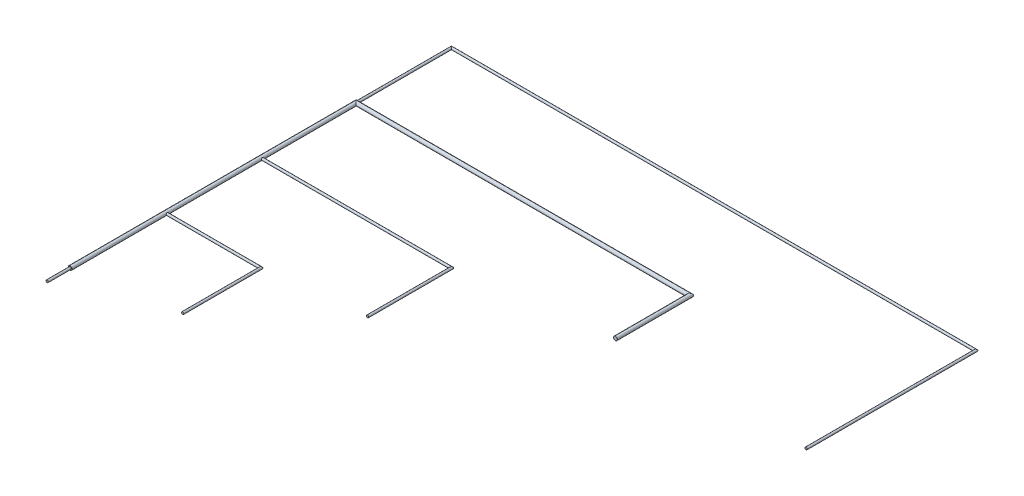
ISO-10303-21;
HEADER;
FILE_DESCRIPTION(('STEP AP214'),'2;1');
FILE_NAME('part.step','',(''),(''),'','','');
FILE_SCHEMA(('AUTOMOTIVE_DESIGN { 1 0 10303 214 1 1 1 1 }'));
ENDSEC;
DATA;
#1=APPLICATION_CONTEXT('core data for automotive mechanical design processes');
#2=APPLICATION_PROTOCOL_DEFINITION('international standard','automotive_design',2000,#1);
#3=PRODUCT_CONTEXT('',#1,'mechanical');
#4=PRODUCT('Part','Part','',(#3));
#5=PRODUCT_RELATED_PRODUCT_CATEGORY('part','',(#4));
#6=PRODUCT_DEFINITION_FORMATION('','',#4);
#7=PRODUCT_DEFINITION_CONTEXT('part definition',#1,'design');
#8=PRODUCT_DEFINITION('design','',#6,#7);
#9=PRODUCT_DEFINITION_SHAPE('','',#8);
#10=(LENGTH_UNIT() NAMED_UNIT(*) SI_UNIT(.MILLI.,.METRE.));
#11=(NAMED_UNIT(*) PLANE_ANGLE_UNIT() SI_UNIT($,.RADIAN.));
#12=(NAMED_UNIT(*) SI_UNIT($,.STERADIAN.) SOLID_ANGLE_UNIT());
#13=UNCERTAINTY_MEASURE_WITH_UNIT(LENGTH_MEASURE(1.E-05),#10,'distance_accuracy_value','');
#14=(GEOMETRIC_REPRESENTATION_CONTEXT(3) GLOBAL_UNCERTAINTY_ASSIGNED_CONTEXT((#13)) GLOBAL_UNIT_ASSIGNED_CONTEXT((#10,
#11,#12)) REPRESENTATION_CONTEXT('',''));
#15=CARTESIAN_POINT('',(0.,0.,0.));
#16=DIRECTION('',(0.,0.,1.));
#17=DIRECTION('',(1.,0.,0.));
#18=AXIS2_PLACEMENT_3D('',#15,#16,#17);
#19=CARTESIAN_POINT('',(1130.21115526702,0.,-225.94745807334));
#20=DIRECTION('',(0.,0.,-1.));
#21=DIRECTION('',(-1.,0.,0.));
#22=AXIS2_PLACEMENT_3D('',#19,#20,#21);
#23=CYLINDRICAL_SURFACE('',#22,0.599999999999934);
#24=CARTESIAN_POINT('',(1130.21115526702,0.,-438.01885807334));
#25=DIRECTION('',(0.707106781186547,0.,-0.707106781186548));
#26=DIRECTION('',(-0.707106781186548,0.,-0.707106781186547));
#27=AXIS2_PLACEMENT_3D('',#24,#25,#26);
#28=ELLIPSE('',#27,0.848528137423764,0.599999999999934);
#29=CARTESIAN_POINT('',(1129.61115526702,0.,-438.618858073339));
#30=VERTEX_POINT('',#29);
#31=EDGE_CURVE('E83',#30,#30,#28,.T.);
#32=ORIENTED_EDGE('',*,*,#31,.F.);
#33=EDGE_LOOP('',(#32));
#34=FACE_BOUND('',#33,.T.);
#35=CARTESIAN_POINT('',(1129.61115526701,0.,-389.018858073339));
#36=CARTESIAN_POINT('',(1129.61115690342,0.0306919333858949,-389.018856576493));
#37=CARTESIAN_POINT('',(1129.61352673538,0.0614329282579737,-389.017429691798));
#38=CARTESIAN_POINT('',(1129.62288499482,0.121990203811974,-389.011857687775));
#39=CARTESIAN_POINT('',(1129.62988481175,0.15180401383831,-389.007705865471));
#40=CARTESIAN_POINT('',(1129.64810981148,0.209500731116331,-388.997104305557));
#41=CARTESIAN_POINT('',(1129.65931405028,0.237392411290542,-388.990665966431));
#42=CARTESIAN_POINT('',(1129.68549940027,0.290812127285728,-388.976039543845));
#43=CARTESIAN_POINT('',(1129.7004795738,0.316340747766442,-388.96785189486));
#44=CARTESIAN_POINT('',(1129.73506519769,0.366519711599597,-388.949679516216));
#45=CARTESIAN_POINT('',(1129.75493674515,0.390953608032397,-388.939605242123));
#46=CARTESIAN_POINT('',(1129.79814214854,0.436353081647392,-388.918979830458));
#47=CARTESIAN_POINT('',(1129.82148044189,0.457314139792309,-388.908428093954));
#48=CARTESIAN_POINT('',(1129.87432467121,0.497779987051815,-388.886502341323));
#49=CARTESIAN_POINT('',(1129.9042359754,0.516791065515184,-388.875186144154));
#50=CARTESIAN_POINT('',(1129.96749389631,0.549445751059541,-388.854611278988));
#51=CARTESIAN_POINT('',(1130.00083482551,0.563098069340574,-388.845349282435));
#52=CARTESIAN_POINT('',(1130.06179384727,0.581762406856822,-388.832276591983));
#53=CARTESIAN_POINT('',(1130.08884966646,0.58806478898725,-388.82768960589));
#54=CARTESIAN_POINT('',(1130.14387675334,0.596864689361843,-388.821219306521));
#55=CARTESIAN_POINT('',(1130.17184683851,0.599366938227287,-388.819332631914));
#56=CARTESIAN_POINT('',(1130.2279598647,0.600422035183957,-388.818541763195));
#57=CARTESIAN_POINT('',(1130.25610303705,0.598967133633585,-388.81964342139));
#58=CARTESIAN_POINT('',(1130.31166677718,0.592184241915266,-388.824671119114));
#59=CARTESIAN_POINT('',(1130.33908678535,0.586853338480403,-388.828599283068));
#60=CARTESIAN_POINT('',(1130.39216736386,0.572695687527157,-388.838670821116));
#61=CARTESIAN_POINT('',(1130.41784608858,0.563914994664295,-388.844784919949));
#62=CARTESIAN_POINT('',(1130.46743326338,0.543180247083277,-388.858566278743));
#63=CARTESIAN_POINT('',(1130.49134106038,0.531225029038775,-388.866234107833));
#64=CARTESIAN_POINT('',(1130.54114890586,0.502071932738287,-388.883879382415));
#65=CARTESIAN_POINT('',(1130.56666650419,0.484322897590811,-388.894026246831));
#66=CARTESIAN_POINT('',(1130.61462586048,0.445164371135946,-388.914580472397));
#67=CARTESIAN_POINT('',(1130.6370646406,0.42375138040229,-388.924988074388));
#68=CARTESIAN_POINT('',(1130.68140045974,0.374324733753188,-388.946600093172));
#69=CARTESIAN_POINT('',(1130.70278618942,0.345807073081961,-388.957713418413));
#70=CARTESIAN_POINT('',(1130.74040408589,0.284910420183557,-388.977947787075));
#71=CARTESIAN_POINT('',(1130.75663900853,0.252533505577382,-388.987069895041));
#72=CARTESIAN_POINT('',(1130.78232814013,0.186879034107236,-389.001779641604));
#73=CARTESIAN_POINT('',(1130.7921454093,0.153787049669384,-389.007553903098));
#74=CARTESIAN_POINT('',(1130.80595974597,0.0860191580578282,-389.015733444593));
#75=CARTESIAN_POINT('',(1130.80996379411,0.0513452022645219,-389.01814276515));
#76=CARTESIAN_POINT('',(1130.81175840608,-0.0134858457509754,-389.019220354838));
#77=CARTESIAN_POINT('',(1130.81031880904,-0.0436169893675314,-389.018352160197));
#78=CARTESIAN_POINT('',(1130.80298492578,-0.103131760794398,-389.013972921687));
#79=CARTESIAN_POINT('',(1130.79709072989,-0.132515403750318,-389.010461931411));
#80=CARTESIAN_POINT('',(1130.78133789389,-0.189029972863197,-389.001237243109));
#81=CARTESIAN_POINT('',(1130.77157912738,-0.216198300371908,-388.995579175991));
#82=CARTESIAN_POINT('',(1130.74848431646,-0.268506299634327,-388.982513596789));
#83=CARTESIAN_POINT('',(1130.73514756647,-0.29364556998353,-388.975105739678));
#84=CARTESIAN_POINT('',(1130.70373247533,-0.344002505131811,-388.958240058297));
#85=CARTESIAN_POINT('',(1130.68530573537,-0.368957660191516,-388.948649284329));
#86=CARTESIAN_POINT('',(1130.64499870962,-0.415610412515243,-388.928755135608));
#87=CARTESIAN_POINT('',(1130.62311440509,-0.437304161061994,-388.91845093957));
#88=CARTESIAN_POINT('',(1130.57319111098,-0.47972798697968,-388.896639769109));
#89=CARTESIAN_POINT('',(1130.54472171274,-0.499964078671362,-388.885151040839));
#90=CARTESIAN_POINT('',(1130.48426885713,-0.535380955795318,-388.863722801924));
#91=CARTESIAN_POINT('',(1130.4522891495,-0.550567067086843,-388.853781665067));
#92=CARTESIAN_POINT('',(1130.39265805806,-0.572570315173131,-388.83879771051));
#93=CARTESIAN_POINT('',(1130.36556314194,-0.580486501398291,-388.833160711591));
#94=CARTESIAN_POINT('',(1130.31014243564,-0.592454655691181,-388.824496497273));
#95=CARTESIAN_POINT('',(1130.28181840924,-0.596511981208456,-388.821465664168));
#96=CARTESIAN_POINT('',(1130.224604488,-0.600536521649434,-388.818459859545));
#97=CARTESIAN_POINT('',(1130.19571287074,-0.60048835642688,-388.818496379054));
#98=CARTESIAN_POINT('',(1130.13839749276,-0.596265891841779,-388.82164894498));
#99=CARTESIAN_POINT('',(1130.10997399498,-0.592089348864038,-388.824766665912));
#100=CARTESIAN_POINT('',(1130.05575989998,-0.58016069659456,-388.833390814294));
#101=CARTESIAN_POINT('',(1130.02990842929,-0.572590547381463,-388.838774920558));
#102=CARTESIAN_POINT('',(1129.97982036522,-0.554252968307818,-388.851280081183));
#103=CARTESIAN_POINT('',(1129.95558438423,-0.543484334352395,-388.858401789497));
#104=CARTESIAN_POINT('',(1129.90542732412,-0.517156982224273,-388.874910035548));
#105=CARTESIAN_POINT('',(1129.87981882547,-0.501116670709484,-388.884476423695));
#106=CARTESIAN_POINT('',(1129.83140323796,-0.465502793549489,-388.904138581437));
#107=CARTESIAN_POINT('',(1129.80859848214,-0.445926318405886,-388.914234782063));
#108=CARTESIAN_POINT('',(1129.76261488737,-0.400039109730087,-388.935760834618));
#109=CARTESIAN_POINT('',(1129.73998283711,-0.373150727838681,-388.947139308445));
#110=CARTESIAN_POINT('',(1129.69951612475,-0.315384973870352,-388.968319789204));
#111=CARTESIAN_POINT('',(1129.68168318229,-0.284506177785585,-388.978121230543));
#112=CARTESIAN_POINT('',(1129.65204094391,-0.220450092325539,-388.994800387998));
#113=CARTESIAN_POINT('',(1129.64006404084,-0.187372034906759,-389.001758383768));
#114=CARTESIAN_POINT('',(1129.62206538875,-0.119189322581194,-389.012323165858));
#115=CARTESIAN_POINT('',(1129.61602119985,-0.0840928398848035,-389.015942576879));
#116=CARTESIAN_POINT('',(1129.61247628513,-0.040623238764281,-389.018066078));
#117=CARTESIAN_POINT('',(1129.61198150009,-0.0325105036104452,-389.018362531961));
#118=CARTESIAN_POINT('',(1129.61132076846,-0.016266328275469,-389.018758731412));
#119=CARTESIAN_POINT('',(1129.61115483328,-0.00813488745527394,-389.018858470078));
#120=CARTESIAN_POINT('',(1129.61115526701,0.,-389.018858073339));
#121=B_SPLINE_CURVE_WITH_KNOTS('',3,(#35,#36,#37,#38,#39,#40,#41,#42,#43,#44,#45,#46,#47,#48,
#49,#50,#51,#52,#53,#54,#55,#56,#57,#58,#59,#60,#61,#62,#63,#64,#65,#66,#67,#68,#69,#70,#71,#72,
#73,#74,#75,#76,#77,#78,#79,#80,#81,#82,#83,#84,#85,#86,#87,#88,#89,#90,#91,#92,#93,#94,#95,#96,
#97,#98,#99,#100,#101,#102,#103,#104,#105,#106,#107,#108,#109,#110,#111,#112,#113,#114,#115,
#116,#117,#118,#119,#120),.UNSPECIFIED.,.T.,.F.,(4,2,2,2,2,2,2,2,2,2,2,2,2,2,2,2,2,2,2,2,2,2,2,
2,2,2,2,2,2,2,2,2,2,2,2,2,2,2,2,2,2,2,4),(0.,0.0920408950194668,0.184309051007966,
0.276123553839829,0.36791527919678,0.466726362929681,0.565665031739066,0.676735252759133,
0.787624162768262,0.871735319422605,0.955741683666319,1.03991268348259,1.12414701309529,
1.20729307037276,1.29046963923941,1.38818798090043,1.48600017921455,1.59744383153856,
1.70882775710112,1.81318716278605,1.91742114767272,2.00750241088949,2.09758184745361,
2.18547114275886,2.27337778263583,2.37040546327317,2.46754676032715,2.57734704971191,
2.68703117046105,2.77303114921538,2.85891155484627,2.9451137030223,3.03136272453559,
3.11345639323728,3.19558100600502,3.2903144401221,3.38512617739355,3.49541724702322,
3.60574778406051,3.71270261782474,3.81925132875583,3.84364589335862,3.86804130412835),.UNSPECIFIED.);
#122=CARTESIAN_POINT('',(1129.61115526701,0.,-389.018858073339));
#123=VERTEX_POINT('',#122);
#124=EDGE_CURVE('E107',#123,#123,#121,.T.);
#125=ORIENTED_EDGE('',*,*,#124,.T.);
#126=EDGE_LOOP('',(#125));
#127=FACE_BOUND('',#126,.T.);
#128=ADVANCED_FACE('F56',(#34,#127),#23,.T.);
#129=CARTESIAN_POINT('',(1405.21172112185,0.,-349.018858073308));
#130=DIRECTION('',(0.,0.,-1.));
#131=DIRECTION('',(-1.,0.,0.));
#132=AXIS2_PLACEMENT_3D('',#129,#130,#131);
#133=PLANE('',#132);
#134=CARTESIAN_POINT('',(1405.21172112185,0.,-349.018858073308));
#135=DIRECTION('',(0.,0.,-1.));
#136=DIRECTION('',(-1.,0.,0.));
#137=AXIS2_PLACEMENT_3D('',#134,#135,#136);
#138=CIRCLE('',#137,0.599999999999934);
#139=CARTESIAN_POINT('',(1404.61172112185,0.,-349.018858073308));
#140=VERTEX_POINT('',#139);
#141=EDGE_CURVE('E187',#140,#140,#138,.T.);
#142=ORIENTED_EDGE('',*,*,#141,.F.);
#143=EDGE_LOOP('',(#142));
#144=FACE_BOUND('',#143,.T.);
#145=ADVANCED_FACE('F97',(#144),#133,.F.);
#146=CARTESIAN_POINT('',(1405.21172112185,0.,-438.77885807334));
#147=DIRECTION('',(0.,0.,1.));
#148=DIRECTION('',(1.,0.,0.));
#149=AXIS2_PLACEMENT_3D('',#146,#147,#148);
#150=CYLINDRICAL_SURFACE('',#149,0.599999999999934);
#151=CARTESIAN_POINT('',(1405.21172112185,0.,-438.01885807334));
#152=DIRECTION('',(0.707106781186548,0.,0.707106781186547));
#153=DIRECTION('',(0.707106781186547,0.,-0.707106781186548));
#154=AXIS2_PLACEMENT_3D('',#151,#152,#153);
#155=ELLIPSE('',#154,0.848528137423764,0.599999999999934);
#156=CARTESIAN_POINT('',(1405.81172112185,0.,-438.61885807334));
#157=VERTEX_POINT('',#156);
#158=EDGE_CURVE('E189',#157,#157,#155,.T.);
#159=ORIENTED_EDGE('',*,*,#158,.T.);
#160=EDGE_LOOP('',(#159));
#161=FACE_BOUND('',#160,.T.);
#162=ORIENTED_EDGE('',*,*,#141,.T.);
#163=EDGE_LOOP('',(#162));
#164=FACE_BOUND('',#163,.T.);
#165=ADVANCED_FACE('F145',(#161,#164),#150,.T.);
#166=CARTESIAN_POINT('',(1129.45115526702,0.,-438.01885807334));
#167=DIRECTION('',(1.,0.,0.));
#168=DIRECTION('',(0.,0.,-1.));
#169=AXIS2_PLACEMENT_3D('',#166,#167,#168);
#170=CYLINDRICAL_SURFACE('',#169,0.599999999999934);
#171=ORIENTED_EDGE('',*,*,#31,.T.);
#172=EDGE_LOOP('',(#171));
#173=FACE_BOUND('',#172,.T.);
#174=ORIENTED_EDGE('',*,*,#158,.F.);
#175=EDGE_LOOP('',(#174));
#176=FACE_BOUND('',#175,.T.);
#177=ADVANCED_FACE('F94',(#173,#176),#170,.T.);
#178=CARTESIAN_POINT('',(1130.21115526702,0.,-238.018858073339));
#179=DIRECTION('',(0.,0.,-1.));
#180=DIRECTION('',(-1.,0.,0.));
#181=AXIS2_PLACEMENT_3D('',#178,#179,#180);
#182=CYLINDRICAL_SURFACE('',#181,0.99999999999989);
#183=CARTESIAN_POINT('',(1130.21115526702,0.,-388.01885807334));
#184=DIRECTION('',(0.707106781186547,0.,-0.707106781186549));
#185=DIRECTION('',(-0.707106781186549,0.,-0.707106781186547));
#186=AXIS2_PLACEMENT_3D('',#183,#184,#185);
#187=ELLIPSE('',#186,1.41421356237294,0.99999999999989);
#188=CARTESIAN_POINT('',(1129.21115526702,0.,-389.01885807334));
#189=VERTEX_POINT('',#188);
#190=EDGE_CURVE('E114',#189,#189,#187,.T.);
#191=ORIENTED_EDGE('',*,*,#190,.F.);
#192=EDGE_LOOP('',(#191));
#193=FACE_BOUND('',#192,.T.);
#194=CARTESIAN_POINT('',(1130.21115526702,0.,-238.018858073339));
#195=DIRECTION('',(0.,0.,1.));
#196=DIRECTION('',(1.,0.,0.));
#197=AXIS2_PLACEMENT_3D('',#194,#195,#196);
#198=CIRCLE('',#197,0.99999999999989);
#199=CARTESIAN_POINT('',(1131.21115526702,0.,-238.018858073339));
#200=VERTEX_POINT('',#199);
#201=EDGE_CURVE('E169',#200,#200,#198,.T.);
#202=ORIENTED_EDGE('',*,*,#201,.F.);
#203=EDGE_LOOP('',(#202));
#204=FACE_BOUND('',#203,.T.);
#205=CARTESIAN_POINT('',(1131.21115526702,0.,-288.61885807334));
#206=CARTESIAN_POINT('',(1131.21115377017,0.03069193338588,-288.618856436934));
#207=CARTESIAN_POINT('',(1131.20972688547,0.0614329282579533,-288.616486604969));
#208=CARTESIAN_POINT('',(1131.20415488145,0.12199020381197,-288.607128345534));
#209=CARTESIAN_POINT('',(1131.20000305915,0.151804013838328,-288.600128528598));
#210=CARTESIAN_POINT('',(1131.18940149923,0.209500731116393,-288.581903528873));
#211=CARTESIAN_POINT('',(1131.18296316011,0.237392411290624,-288.570699290074));
#212=CARTESIAN_POINT('',(1131.16833673752,0.290812127285816,-288.544513940083));
#213=CARTESIAN_POINT('',(1131.16014908854,0.316340747766523,-288.529533766552));
#214=CARTESIAN_POINT('',(1131.14197670989,0.366519711599711,-288.494948142656));
#215=CARTESIAN_POINT('',(1131.1319024358,0.390953608032539,-288.475076595199));
#216=CARTESIAN_POINT('',(1131.11127702413,0.436353081647509,-288.431871191808));
#217=CARTESIAN_POINT('',(1131.10072528763,0.457314139792382,-288.408532898465));
#218=CARTESIAN_POINT('',(1131.078799535,0.497779987051835,-288.355688669141));
#219=CARTESIAN_POINT('',(1131.06748333783,0.516791065515192,-288.325777364947));
#220=CARTESIAN_POINT('',(1131.04690847266,0.549445751059541,-288.262519444042));
#221=CARTESIAN_POINT('',(1131.03764647611,0.563098069340577,-288.229178514841));
#222=CARTESIAN_POINT('',(1131.02457378566,0.581762406856821,-288.168219493078));
#223=CARTESIAN_POINT('',(1131.01998679957,0.588064788987247,-288.141163673896));
#224=CARTESIAN_POINT('',(1131.0135165002,0.596864689361843,-288.086136587008));
#225=CARTESIAN_POINT('',(1131.01162982559,0.59936693822728,-288.058166501838));
#226=CARTESIAN_POINT('',(1131.01083895687,0.600422035183966,-288.002053475653));
#227=CARTESIAN_POINT('',(1131.01194061507,0.598967133633607,-287.973910303302));
#228=CARTESIAN_POINT('',(1131.01696831279,0.592184241915244,-287.918346563169));
#229=CARTESIAN_POINT('',(1131.02089647674,0.586853338480342,-287.890926555001));
#230=CARTESIAN_POINT('',(1131.03096801479,0.572695687527111,-287.837845976488));
#231=CARTESIAN_POINT('',(1131.03708211363,0.563914994664301,-287.81216725177));
#232=CARTESIAN_POINT('',(1131.05086347242,0.543180247083291,-287.762580076969));
#233=CARTESIAN_POINT('',(1131.05853130151,0.531225029038743,-287.73867227997));
#234=CARTESIAN_POINT('',(1131.07617657609,0.502071932738263,-287.688864434491));
#235=CARTESIAN_POINT('',(1131.08632344051,0.48432289759086,-287.663346836158));
#236=CARTESIAN_POINT('',(1131.10687766607,0.445164371135994,-287.615387479873));
#237=CARTESIAN_POINT('',(1131.11728526806,0.423751380402275,-287.592948699749));
#238=CARTESIAN_POINT('',(1131.13889728685,0.374324733753142,-287.548612880611));
#239=CARTESIAN_POINT('',(1131.15001061209,0.345807073081959,-287.527227150933));
#240=CARTESIAN_POINT('',(1131.17024498075,0.284910420183596,-287.489609254461));
#241=CARTESIAN_POINT('',(1131.17936708872,0.252533505577419,-287.473374331824));
#242=CARTESIAN_POINT('',(1131.19407683528,0.186879034107278,-287.447685200221));
#243=CARTESIAN_POINT('',(1131.19985109677,0.153787049669434,-287.437867931053));
#244=CARTESIAN_POINT('',(1131.20803063827,0.0860191580578686,-287.424053594378));
#245=CARTESIAN_POINT('',(1131.21043995883,0.0513452022645445,-287.420049546238));
#246=CARTESIAN_POINT('',(1131.21151754851,-0.0134858457509748,-287.418254934268));
#247=CARTESIAN_POINT('',(1131.21064935387,-0.0436169893675355,-287.419694531306));
#248=CARTESIAN_POINT('',(1131.20627011536,-0.103131760794389,-287.427028414568));
#249=CARTESIAN_POINT('',(1131.20275912509,-0.132515403750291,-287.432922610462));
#250=CARTESIAN_POINT('',(1131.19353443678,-0.189029972863186,-287.448675446465));
#251=CARTESIAN_POINT('',(1131.18787636967,-0.216198300371929,-287.458434212969));
#252=CARTESIAN_POINT('',(1131.17481079047,-0.268506299634352,-287.481529023886));
#253=CARTESIAN_POINT('',(1131.16740293335,-0.293645569983525,-287.494865773877));
#254=CARTESIAN_POINT('',(1131.15053725197,-0.344002505131788,-287.526280865024));
#255=CARTESIAN_POINT('',(1131.14094647801,-0.368957660191513,-287.544707604976));
#256=CARTESIAN_POINT('',(1131.12105232928,-0.41561041251522,-287.58501463073));
#257=CARTESIAN_POINT('',(1131.11074813325,-0.43730416106193,-287.606898935263));
#258=CARTESIAN_POINT('',(1131.08893696279,-0.479727986979574,-287.656822229375));
#259=CARTESIAN_POINT('',(1131.07744823452,-0.499964078671267,-287.685291627606));
#260=CARTESIAN_POINT('',(1131.0560199956,-0.535380955795228,-287.745744483216));
#261=CARTESIAN_POINT('',(1131.04607885874,-0.55056706708674,-287.777724190853));
#262=CARTESIAN_POINT('',(1131.03109490419,-0.572570315173041,-287.837355282286));
#263=CARTESIAN_POINT('',(1131.02545790527,-0.580486501398218,-287.864450198412));
#264=CARTESIAN_POINT('',(1131.01679369095,-0.592454655691128,-287.919870904711));
#265=CARTESIAN_POINT('',(1131.01376285784,-0.596511981208416,-287.948194931115));
#266=CARTESIAN_POINT('',(1131.01075705322,-0.600536521649438,-288.005408852348));
#267=CARTESIAN_POINT('',(1131.01079357273,-0.600488356426889,-288.034300469606));
#268=CARTESIAN_POINT('',(1131.01394613866,-0.5962658918418,-288.091615847591));
#269=CARTESIAN_POINT('',(1131.01706385959,-0.592089348864087,-288.120039345374));
#270=CARTESIAN_POINT('',(1131.02568800797,-0.580160696594608,-288.174253440366));
#271=CARTESIAN_POINT('',(1131.03107211424,-0.572590547381477,-288.200104911062));
#272=CARTESIAN_POINT('',(1131.04357727486,-0.554252968307881,-288.25019297513));
#273=CARTESIAN_POINT('',(1131.05069898317,-0.543484334352548,-288.274428956125));
#274=CARTESIAN_POINT('',(1131.06720722922,-0.517156982224509,-288.324586016227));
#275=CARTESIAN_POINT('',(1131.07677361737,-0.501116670709692,-288.350194514878));
#276=CARTESIAN_POINT('',(1131.09643577511,-0.465502793549722,-288.39861010239));
#277=CARTESIAN_POINT('',(1131.10653197574,-0.445926318406166,-288.421414858213));
#278=CARTESIAN_POINT('',(1131.12805802829,-0.400039109730426,-288.46739845298));
#279=CARTESIAN_POINT('',(1131.13943650212,-0.373150727839025,-288.490030503245));
#280=CARTESIAN_POINT('',(1131.16061698288,-0.31538497387076,-288.530497215602));
#281=CARTESIAN_POINT('',(1131.17041842422,-0.28450617778604,-288.548330158061));
#282=CARTESIAN_POINT('',(1131.18709758167,-0.220450092326009,-288.577972396443));
#283=CARTESIAN_POINT('',(1131.19405557744,-0.187372034907199,-288.589949299515));
#284=CARTESIAN_POINT('',(1131.20462035953,-0.119189322581629,-288.6079479516));
#285=CARTESIAN_POINT('',(1131.20823977056,-0.084092839885264,-288.6139921405));
#286=CARTESIAN_POINT('',(1131.21036327168,-0.0406232387646278,-288.617537055219));
#287=CARTESIAN_POINT('',(1131.21065972564,-0.0325105036107151,-288.618031840261));
#288=CARTESIAN_POINT('',(1131.21105592509,-0.0162663282755978,-288.618692571889));
#289=CARTESIAN_POINT('',(1131.21115566375,-0.00813488745533872,-288.618858507068));
#290=CARTESIAN_POINT('',(1131.21115526702,0.,-288.61885807334));
#291=B_SPLINE_CURVE_WITH_KNOTS('',3,(#205,#206,#207,#208,#209,#210,#211,#212,#213,#214,#215,
#216,#217,#218,#219,#220,#221,#222,#223,#224,#225,#226,#227,#228,#229,#230,#231,#232,#233,#234,
#235,#236,#237,#238,#239,#240,#241,#242,#243,#244,#245,#246,#247,#248,#249,#250,#251,#252,#253,
#254,#255,#256,#257,#258,#259,#260,#261,#262,#263,#264,#265,#266,#267,#268,#269,#270,#271,#272,
#273,#274,#275,#276,#277,#278,#279,#280,#281,#282,#283,#284,#285,#286,#287,#288,#289,#290),
.UNSPECIFIED.,.T.,.F.,(4,2,2,2,2,2,2,2,2,2,2,2,2,2,2,2,2,2,2,2,2,2,2,2,2,2,2,2,2,2,2,2,2,2,2,2,
2,2,2,2,2,2,4),(0.,0.0920408950194603,0.184309051007991,0.27612355384,0.367915279196825,
0.466726362929885,0.565665031739153,0.676735252759201,0.787624162768333,0.871735319422485,
0.955741683666259,1.03991268348281,1.12414701309537,1.20729307037271,1.29046963923934,
1.38818798090051,1.48600017921447,1.59744383153856,1.70882775710112,1.81318716278604,
1.91742114767274,2.00750241088951,2.09758184745363,2.18547114275886,2.27337778263587,
2.37040546327321,2.46754676032713,2.57734704971169,2.68703117046078,2.77303114921514,
2.85891155484581,2.94511370302218,3.03136272453535,3.11345639323711,3.19558100600469,
3.29031444012166,3.38512617739318,3.49541724702265,3.60574778406001,3.71270261782427,
3.81925132875542,3.84364589335842,3.86804130412835),.UNSPECIFIED.);
#292=CARTESIAN_POINT('',(1131.21115526702,0.,-288.61885807334));
#293=VERTEX_POINT('',#292);
#294=EDGE_CURVE('E60',#293,#293,#291,.T.);
#295=ORIENTED_EDGE('',*,*,#294,.F.);
#296=EDGE_LOOP('',(#295));
#297=FACE_BOUND('',#296,.T.);
#298=CARTESIAN_POINT('',(1131.21115526702,0.,-338.61885807334));
#299=CARTESIAN_POINT('',(1131.21115377017,-0.0306919333858856,-338.618856436934));
#300=CARTESIAN_POINT('',(1131.20972688547,-0.0614329282579663,-338.616486604968));
#301=CARTESIAN_POINT('',(1131.20415488145,-0.121990203811975,-338.607128345534));
#302=CARTESIAN_POINT('',(1131.20000305915,-0.151804013838316,-338.600128528598));
#303=CARTESIAN_POINT('',(1131.18940149923,-0.209500731116355,-338.581903528873));
#304=CARTESIAN_POINT('',(1131.18296316011,-0.237392411290579,-338.570699290074));
#305=CARTESIAN_POINT('',(1131.16833673752,-0.290812127285767,-338.544513940083));
#306=CARTESIAN_POINT('',(1131.16014908854,-0.316340747766472,-338.529533766552));
#307=CARTESIAN_POINT('',(1131.14197670989,-0.366519711599663,-338.494948142656));
#308=CARTESIAN_POINT('',(1131.1319024358,-0.39095360803251,-338.475076595199));
#309=CARTESIAN_POINT('',(1131.11127702413,-0.436353081647526,-338.431871191808));
#310=CARTESIAN_POINT('',(1131.10072528763,-0.457314139792419,-338.408532898465));
#311=CARTESIAN_POINT('',(1131.078799535,-0.497779987051868,-338.355688669141));
#312=CARTESIAN_POINT('',(1131.06748333783,-0.5167910655152,-338.325777364947));
#313=CARTESIAN_POINT('',(1131.04690847266,-0.549445751059533,-338.262519444042));
#314=CARTESIAN_POINT('',(1131.03764647611,-0.563098069340579,-338.22917851484));
#315=CARTESIAN_POINT('',(1131.02457378566,-0.581762406856826,-338.168219493078));
#316=CARTESIAN_POINT('',(1131.01998679957,-0.588064788987248,-338.141163673895));
#317=CARTESIAN_POINT('',(1131.0135165002,-0.596864689361839,-338.086136587007));
#318=CARTESIAN_POINT('',(1131.01162982559,-0.599366938227279,-338.058166501838));
#319=CARTESIAN_POINT('',(1131.01083895687,-0.600422035183967,-338.002053475653));
#320=CARTESIAN_POINT('',(1131.01194061507,-0.598967133633606,-337.973910303302));
#321=CARTESIAN_POINT('',(1131.01696831279,-0.592184241915239,-337.918346563168));
#322=CARTESIAN_POINT('',(1131.02089647674,-0.586853338480333,-337.890926555001));
#323=CARTESIAN_POINT('',(1131.03096801479,-0.572695687527092,-337.837845976488));
#324=CARTESIAN_POINT('',(1131.03708211363,-0.563914994664282,-337.81216725177));
#325=CARTESIAN_POINT('',(1131.05086347242,-0.543180247083288,-337.762580076968));
#326=CARTESIAN_POINT('',(1131.05853130151,-0.531225029038745,-337.73867227997));
#327=CARTESIAN_POINT('',(1131.07617657609,-0.502071932738222,-337.68886443449));
#328=CARTESIAN_POINT('',(1131.08632344051,-0.484322897590762,-337.663346836158));
#329=CARTESIAN_POINT('',(1131.10687766607,-0.445164371135871,-337.615387479873));
#330=CARTESIAN_POINT('',(1131.11728526806,-0.423751380402182,-337.592948699749));
#331=CARTESIAN_POINT('',(1131.13889728685,-0.374324733753058,-337.548612880611));
#332=CARTESIAN_POINT('',(1131.15001061209,-0.345807073081847,-337.527227150933));
#333=CARTESIAN_POINT('',(1131.17024498075,-0.284910420183444,-337.48960925446));
#334=CARTESIAN_POINT('',(1131.17936708872,-0.252533505577257,-337.473374331824));
#335=CARTESIAN_POINT('',(1131.19407683528,-0.186879034107116,-337.447685200221));
#336=CARTESIAN_POINT('',(1131.19985109677,-0.153787049669281,-337.437867931053));
#337=CARTESIAN_POINT('',(1131.20803063827,-0.0860191580577556,-337.424053594377));
#338=CARTESIAN_POINT('',(1131.21043995883,-0.0513452022644637,-337.420049546238));
#339=CARTESIAN_POINT('',(1131.21151754851,0.0134858457510233,-337.418254934268));
#340=CARTESIAN_POINT('',(1131.21064935387,0.0436169893675815,-337.419694531306));
#341=CARTESIAN_POINT('',(1131.20627011536,0.103131760794429,-337.427028414568));
#342=CARTESIAN_POINT('',(1131.20275912509,0.132515403750327,-337.432922610462));
#343=CARTESIAN_POINT('',(1131.19353443678,0.189029972863243,-337.448675446465));
#344=CARTESIAN_POINT('',(1131.18787636967,0.216198300372011,-337.458434212969));
#345=CARTESIAN_POINT('',(1131.17481079047,0.268506299634429,-337.481529023886));
#346=CARTESIAN_POINT('',(1131.16740293335,0.293645569983576,-337.494865773877));
#347=CARTESIAN_POINT('',(1131.15053725197,0.344002505131822,-337.526280865024));
#348=CARTESIAN_POINT('',(1131.14094647801,0.368957660191556,-337.544707604976));
#349=CARTESIAN_POINT('',(1131.12105232928,0.415610412515261,-337.58501463073));
#350=CARTESIAN_POINT('',(1131.11074813325,0.437304161061962,-337.606898935263));
#351=CARTESIAN_POINT('',(1131.08893696279,0.479727986979606,-337.656822229375));
#352=CARTESIAN_POINT('',(1131.07744823452,0.499964078671312,-337.685291627606));
#353=CARTESIAN_POINT('',(1131.0560199956,0.53538095579528,-337.745744483216));
#354=CARTESIAN_POINT('',(1131.04607885874,0.550567067086779,-337.777724190853));
#355=CARTESIAN_POINT('',(1131.03109490419,0.572570315173091,-337.837355282286));
#356=CARTESIAN_POINT('',(1131.02545790527,0.580486501398284,-337.864450198412));
#357=CARTESIAN_POINT('',(1131.01679369095,0.592454655691178,-337.919870904711));
#358=CARTESIAN_POINT('',(1131.01376285784,0.596511981208446,-337.948194931115));
#359=CARTESIAN_POINT('',(1131.01075705322,0.600536521649439,-338.005408852349));
#360=CARTESIAN_POINT('',(1131.01079357273,0.600488356426882,-338.034300469606));
#361=CARTESIAN_POINT('',(1131.01394613866,0.596265891841773,-338.091615847591));
#362=CARTESIAN_POINT('',(1131.01706385959,0.592089348864044,-338.120039345374));
#363=CARTESIAN_POINT('',(1131.02568800797,0.580160696594546,-338.174253440366));
#364=CARTESIAN_POINT('',(1131.03107211424,0.572590547381417,-338.200104911062));
#365=CARTESIAN_POINT('',(1131.04357727486,0.554252968307814,-338.25019297513));
#366=CARTESIAN_POINT('',(1131.05069898317,0.543484334352471,-338.274428956125));
#367=CARTESIAN_POINT('',(1131.06720722922,0.517156982224411,-338.324586016227));
#368=CARTESIAN_POINT('',(1131.07677361737,0.501116670709584,-338.350194514878));
#369=CARTESIAN_POINT('',(1131.09643577511,0.465502793549574,-338.39861010239));
#370=CARTESIAN_POINT('',(1131.10653197574,0.445926318405985,-338.421414858213));
#371=CARTESIAN_POINT('',(1131.12805802829,0.400039109730231,-338.46739845298));
#372=CARTESIAN_POINT('',(1131.13943650212,0.373150727838861,-338.490030503245));
#373=CARTESIAN_POINT('',(1131.16061698288,0.315384973870594,-338.530497215602));
#374=CARTESIAN_POINT('',(1131.17041842422,0.284506177785842,-338.548330158061));
#375=CARTESIAN_POINT('',(1131.18709758167,0.220450092325796,-338.577972396443));
#376=CARTESIAN_POINT('',(1131.19405557744,0.187372034907002,-338.589949299515));
#377=CARTESIAN_POINT('',(1131.20462035953,0.119189322581418,-338.6079479516));
#378=CARTESIAN_POINT('',(1131.20823977055,0.0840928398850195,-338.6139921405));
#379=CARTESIAN_POINT('',(1131.21036327168,0.0406232387644149,-338.617537055219));
#380=CARTESIAN_POINT('',(1131.21065972564,0.0325105036105498,-338.618031840261));
#381=CARTESIAN_POINT('',(1131.21105592509,0.0162663282755195,-338.618692571889));
#382=CARTESIAN_POINT('',(1131.21115566375,0.0081348874552996,-338.618858507068));
#383=CARTESIAN_POINT('',(1131.21115526702,0.,-338.61885807334));
#384=B_SPLINE_CURVE_WITH_KNOTS('',3,(#298,#299,#300,#301,#302,#303,#304,#305,#306,#307,#308,
#309,#310,#311,#312,#313,#314,#315,#316,#317,#318,#319,#320,#321,#322,#323,#324,#325,#326,#327,
#328,#329,#330,#331,#332,#333,#334,#335,#336,#337,#338,#339,#340,#341,#342,#343,#344,#345,#346,
#347,#348,#349,#350,#351,#352,#353,#354,#355,#356,#357,#358,#359,#360,#361,#362,#363,#364,#365,
#366,#367,#368,#369,#370,#371,#372,#373,#374,#375,#376,#377,#378,#379,#380,#381,#382,#383),
.UNSPECIFIED.,.T.,.F.,(4,2,2,2,2,2,2,2,2,2,2,2,2,2,2,2,2,2,2,2,2,2,2,2,2,2,2,2,2,2,2,2,2,2,2,2,
2,2,2,2,2,2,4),(0.,0.0920408950194578,0.184309051007993,0.276123553839883,0.367915279196851,
0.466726362929802,0.565665031739156,0.676735252759182,0.787624162768263,0.871735319422504,
0.955741683666278,1.03991268348284,1.12414701309542,1.20729307037265,1.29046963923946,
1.38818798090064,1.48600017921467,1.59744383153876,1.70882775710128,1.81318716278616,
1.9174211476728,2.00750241088955,2.0975818474537,2.185471142759,2.27337778263595,
2.3704054632733,2.46754676032721,2.57734704971175,2.68703117046095,2.77303114921547,
2.85891155484609,2.9451137030224,3.03136272453561,3.1134563932373,3.19558100600489,
3.29031444012188,3.3851261773935,3.4954172470229,3.60574778406021,3.71270261782444,
3.81925132875566,3.84364589335852,3.86804130412833),.UNSPECIFIED.);
#385=CARTESIAN_POINT('',(1131.21115526702,0.,-338.61885807334));
#386=VERTEX_POINT('',#385);
#387=EDGE_CURVE('E11',#386,#386,#384,.T.);
#388=ORIENTED_EDGE('',*,*,#387,.T.);
#389=EDGE_LOOP('',(#388));
#390=FACE_BOUND('',#389,.T.);
#391=ADVANCED_FACE('F89',(#193,#204,#297,#390),#182,.T.);
#392=CARTESIAN_POINT('',(1305.21172112185,0.,-349.018858073308));
#393=DIRECTION('',(0.,0.,-1.));
#394=DIRECTION('',(-1.,0.,0.));
#395=AXIS2_PLACEMENT_3D('',#392,#393,#394);
#396=PLANE('',#395);
#397=CARTESIAN_POINT('',(1305.21172112185,0.,-349.018858073308));
#398=DIRECTION('',(0.,0.,-1.));
#399=DIRECTION('',(-1.,0.,0.));
#400=AXIS2_PLACEMENT_3D('',#397,#398,#399);
#401=CIRCLE('',#400,0.99999999999989);
#402=CARTESIAN_POINT('',(1304.21172112185,0.,-349.018858073308));
#403=VERTEX_POINT('',#402);
#404=EDGE_CURVE('E81',#403,#403,#401,.T.);
#405=ORIENTED_EDGE('',*,*,#404,.F.);
#406=EDGE_LOOP('',(#405));
#407=FACE_BOUND('',#406,.T.);
#408=ADVANCED_FACE('F93',(#407),#396,.F.);
#409=CARTESIAN_POINT('',(1130.21115526702,0.,-238.018858073339));
#410=DIRECTION('',(0.,0.,1.));
#411=DIRECTION('',(1.,0.,0.));
#412=AXIS2_PLACEMENT_3D('',#409,#410,#411);
#413=PLANE('',#412);
#414=CARTESIAN_POINT('',(1130.21115526702,0.,-238.018858073339));
#415=DIRECTION('',(0.,0.,1.));
#416=DIRECTION('',(1.,0.,0.));
#417=AXIS2_PLACEMENT_3D('',#414,#415,#416);
#418=CIRCLE('',#417,0.599999999999934);
#419=CARTESIAN_POINT('',(1130.81115526702,0.,-238.018858073339));
#420=VERTEX_POINT('',#419);
#421=EDGE_CURVE('E69',#420,#420,#418,.F.);
#422=ORIENTED_EDGE('',*,*,#421,.T.);
#423=EDGE_LOOP('',(#422));
#424=FACE_BOUND('',#423,.T.);
#425=ORIENTED_EDGE('',*,*,#201,.T.);
#426=EDGE_LOOP('',(#425));
#427=FACE_BOUND('',#426,.T.);
#428=ADVANCED_FACE('F137',(#424,#427),#413,.T.);
#429=CARTESIAN_POINT('',(1305.21172112185,0.,-389.21885807334));
#430=DIRECTION('',(0.,0.,1.));
#431=DIRECTION('',(1.,0.,0.));
#432=AXIS2_PLACEMENT_3D('',#429,#430,#431);
#433=CYLINDRICAL_SURFACE('',#432,0.99999999999989);
#434=CARTESIAN_POINT('',(1305.21172112185,0.,-388.01885807334));
#435=DIRECTION('',(0.707106781186548,0.,0.707106781186547));
#436=DIRECTION('',(0.707106781186547,0.,-0.707106781186548));
#437=AXIS2_PLACEMENT_3D('',#434,#435,#436);
#438=ELLIPSE('',#437,1.41421356237294,0.99999999999989);
#439=CARTESIAN_POINT('',(1306.21172112185,0.,-389.01885807334));
#440=VERTEX_POINT('',#439);
#441=EDGE_CURVE('E171',#440,#440,#438,.T.);
#442=ORIENTED_EDGE('',*,*,#441,.T.);
#443=EDGE_LOOP('',(#442));
#444=FACE_BOUND('',#443,.T.);
#445=ORIENTED_EDGE('',*,*,#404,.T.);
#446=EDGE_LOOP('',(#445));
#447=FACE_BOUND('',#446,.T.);
#448=ADVANCED_FACE('F103',(#444,#447),#433,.T.);
#449=CARTESIAN_POINT('',(1129.01115526702,0.,-388.018858073339));
#450=DIRECTION('',(1.,0.,0.));
#451=DIRECTION('',(0.,0.,-1.));
#452=AXIS2_PLACEMENT_3D('',#449,#450,#451);
#453=CYLINDRICAL_SURFACE('',#452,0.99999999999989);
#454=ORIENTED_EDGE('',*,*,#124,.F.);
#455=EDGE_LOOP('',(#454));
#456=FACE_BOUND('',#455,.T.);
#457=ORIENTED_EDGE('',*,*,#190,.T.);
#458=EDGE_LOOP('',(#457));
#459=FACE_BOUND('',#458,.T.);
#460=ORIENTED_EDGE('',*,*,#441,.F.);
#461=EDGE_LOOP('',(#460));
#462=FACE_BOUND('',#461,.T.);
#463=ADVANCED_FACE('F96',(#456,#459,#462),#453,.T.);
#464=CARTESIAN_POINT('',(1130.21115526702,0.,-225.94745807334));
#465=DIRECTION('',(0.,0.,-1.));
#466=DIRECTION('',(-1.,0.,0.));
#467=AXIS2_PLACEMENT_3D('',#464,#465,#466);
#468=PLANE('',#467);
#469=CARTESIAN_POINT('',(1130.21115526702,0.,-225.94745807334));
#470=DIRECTION('',(0.,0.,-1.));
#471=DIRECTION('',(-1.,0.,0.));
#472=AXIS2_PLACEMENT_3D('',#469,#470,#471);
#473=CIRCLE('',#472,0.599999999999934);
#474=CARTESIAN_POINT('',(1129.61115526702,0.,-225.94745807334));
#475=VERTEX_POINT('',#474);
#476=EDGE_CURVE('E74',#475,#475,#473,.T.);
#477=ORIENTED_EDGE('',*,*,#476,.F.);
#478=EDGE_LOOP('',(#477));
#479=FACE_BOUND('',#478,.T.);
#480=ADVANCED_FACE('F102',(#479),#468,.F.);
#481=ORIENTED_EDGE('',*,*,#421,.F.);
#482=EDGE_LOOP('',(#481));
#483=FACE_BOUND('',#482,.T.);
#484=ORIENTED_EDGE('',*,*,#476,.T.);
#485=EDGE_LOOP('',(#484));
#486=FACE_BOUND('',#485,.T.);
#487=ADVANCED_FACE('F117',(#483,#486),#23,.T.);
#488=CARTESIAN_POINT('',(1180.21115526702,0.,-247.018858073308));
#489=DIRECTION('',(0.,0.,1.));
#490=DIRECTION('',(1.,0.,0.));
#491=AXIS2_PLACEMENT_3D('',#488,#489,#490);
#492=PLANE('',#491);
#493=CARTESIAN_POINT('',(1180.21115526702,0.,-247.018858073308));
#494=DIRECTION('',(0.,0.,1.));
#495=DIRECTION('',(1.,0.,0.));
#496=AXIS2_PLACEMENT_3D('',#493,#494,#495);
#497=CIRCLE('',#496,0.599999999999934);
#498=CARTESIAN_POINT('',(1180.81115526702,0.,-247.018858073308));
#499=VERTEX_POINT('',#498);
#500=EDGE_CURVE('E115',#499,#499,#497,.T.);
#501=ORIENTED_EDGE('',*,*,#500,.T.);
#502=EDGE_LOOP('',(#501));
#503=FACE_BOUND('',#502,.T.);
#504=ADVANCED_FACE('F58',(#503),#492,.T.);
#505=CARTESIAN_POINT('',(1180.21115526702,0.,-288.778858073343));
#506=DIRECTION('',(0.,0.,1.));
#507=DIRECTION('',(1.,0.,0.));
#508=AXIS2_PLACEMENT_3D('',#505,#506,#507);
#509=CYLINDRICAL_SURFACE('',#508,0.599999999999934);
#510=CARTESIAN_POINT('',(1180.21115526702,0.,-288.018858073342));
#511=DIRECTION('',(0.707106781186586,0.,0.707106781186509));
#512=DIRECTION('',(0.707106781186509,0.,-0.707106781186586));
#513=AXIS2_PLACEMENT_3D('',#510,#511,#512);
#514=ELLIPSE('',#513,0.848528137423764,0.599999999999934);
#515=CARTESIAN_POINT('',(1180.81115526702,0.,-288.618858073342));
#516=VERTEX_POINT('',#515);
#517=EDGE_CURVE('E202',#516,#516,#514,.F.);
#518=ORIENTED_EDGE('',*,*,#517,.F.);
#519=EDGE_LOOP('',(#518));
#520=FACE_BOUND('',#519,.T.);
#521=ORIENTED_EDGE('',*,*,#500,.F.);
#522=EDGE_LOOP('',(#521));
#523=FACE_BOUND('',#522,.T.);
#524=ADVANCED_FACE('F127',(#520,#523),#509,.T.);
#525=CARTESIAN_POINT('',(1129.45115526702,0.,-288.01885807334));
#526=DIRECTION('',(1.,0.,0.));
#527=DIRECTION('',(0.,0.,-1.));
#528=AXIS2_PLACEMENT_3D('',#525,#526,#527);
#529=CYLINDRICAL_SURFACE('',#528,0.599999999999934);
#530=ORIENTED_EDGE('',*,*,#517,.T.);
#531=EDGE_LOOP('',(#530));
#532=FACE_BOUND('',#531,.T.);
#533=ORIENTED_EDGE('',*,*,#294,.T.);
#534=EDGE_LOOP('',(#533));
#535=FACE_BOUND('',#534,.T.);
#536=ADVANCED_FACE('F123',(#532,#535),#529,.T.);
#537=CARTESIAN_POINT('',(1230.21172112185,0.,-294.018858073308));
#538=DIRECTION('',(0.,0.,-1.));
#539=DIRECTION('',(-1.,0.,0.));
#540=AXIS2_PLACEMENT_3D('',#537,#538,#539);
#541=PLANE('',#540);
#542=CARTESIAN_POINT('',(1230.21172112185,0.,-294.018858073308));
#543=DIRECTION('',(0.,0.,-1.));
#544=DIRECTION('',(-1.,0.,0.));
#545=AXIS2_PLACEMENT_3D('',#542,#543,#544);
#546=CIRCLE('',#545,0.599999999999934);
#547=CARTESIAN_POINT('',(1229.61172112185,0.,-294.018858073308));
#548=VERTEX_POINT('',#547);
#549=EDGE_CURVE('E198',#548,#548,#546,.T.);
#550=ORIENTED_EDGE('',*,*,#549,.F.);
#551=EDGE_LOOP('',(#550));
#552=FACE_BOUND('',#551,.T.);
#553=ADVANCED_FACE('F122',(#552),#541,.F.);
#554=CARTESIAN_POINT('',(1230.21172112184,0.,-338.778858073342));
#555=DIRECTION('',(0.,0.,1.));
#556=DIRECTION('',(1.,0.,0.));
#557=AXIS2_PLACEMENT_3D('',#554,#555,#556);
#558=CYLINDRICAL_SURFACE('',#557,0.599999999999934);
#559=CARTESIAN_POINT('',(1230.21172112184,0.,-338.018858073343));
#560=DIRECTION('',(0.707106781186567,0.,0.707106781186528));
#561=DIRECTION('',(0.707106781186528,0.,-0.707106781186567));
#562=AXIS2_PLACEMENT_3D('',#559,#560,#561);
#563=ELLIPSE('',#562,0.848528137423766,0.599999999999934);
#564=CARTESIAN_POINT('',(1230.81172112184,0.,-338.618858073342));
#565=VERTEX_POINT('',#564);
#566=EDGE_CURVE('E195',#565,#565,#563,.T.);
#567=ORIENTED_EDGE('',*,*,#566,.T.);
#568=EDGE_LOOP('',(#567));
#569=FACE_BOUND('',#568,.T.);
#570=ORIENTED_EDGE('',*,*,#549,.T.);
#571=EDGE_LOOP('',(#570));
#572=FACE_BOUND('',#571,.T.);
#573=ADVANCED_FACE('F229',(#569,#572),#558,.T.);
#574=CARTESIAN_POINT('',(1129.45115526702,0.,-338.01885807334));
#575=DIRECTION('',(1.,0.,0.));
#576=DIRECTION('',(0.,0.,-1.));
#577=AXIS2_PLACEMENT_3D('',#574,#575,#576);
#578=CYLINDRICAL_SURFACE('',#577,0.599999999999934);
#579=ORIENTED_EDGE('',*,*,#566,.F.);
#580=EDGE_LOOP('',(#579));
#581=FACE_BOUND('',#580,.T.);
#582=ORIENTED_EDGE('',*,*,#387,.F.);
#583=EDGE_LOOP('',(#582));
#584=FACE_BOUND('',#583,.T.);
#585=ADVANCED_FACE('F85',(#581,#584),#578,.T.);
#586=CLOSED_SHELL('',(#128,#145,#165,#177,#391,#408,#428,#448,#463,#480,#487,#504,#524,#536,
#553,#573,#585));
#587=MANIFOLD_SOLID_BREP('B2',#586);
#588=ADVANCED_BREP_SHAPE_REPRESENTATION('',(#18,#587),#14);
#589=SHAPE_DEFINITION_REPRESENTATION(#9,#588);
ENDSEC;
END-ISO-10303-21;
